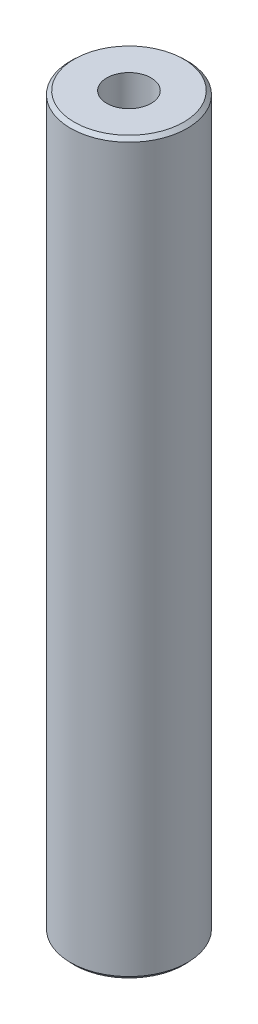
ISO-10303-21;
HEADER;
FILE_DESCRIPTION(('STEP AP214'),'2;1');
FILE_NAME('part.step','',(''),(''),'','','');
FILE_SCHEMA(('AUTOMOTIVE_DESIGN { 1 0 10303 214 1 1 1 1 }'));
ENDSEC;
DATA;
#1=APPLICATION_CONTEXT('core data for automotive mechanical design processes');
#2=APPLICATION_PROTOCOL_DEFINITION('international standard','automotive_design',2000,#1);
#3=PRODUCT_CONTEXT('',#1,'mechanical');
#4=PRODUCT('Part','Part','',(#3));
#5=PRODUCT_RELATED_PRODUCT_CATEGORY('part','',(#4));
#6=PRODUCT_DEFINITION_FORMATION('','',#4);
#7=PRODUCT_DEFINITION_CONTEXT('part definition',#1,'design');
#8=PRODUCT_DEFINITION('design','',#6,#7);
#9=PRODUCT_DEFINITION_SHAPE('','',#8);
#10=(LENGTH_UNIT() NAMED_UNIT(*) SI_UNIT(.MILLI.,.METRE.));
#11=(NAMED_UNIT(*) PLANE_ANGLE_UNIT() SI_UNIT($,.RADIAN.));
#12=(NAMED_UNIT(*) SI_UNIT($,.STERADIAN.) SOLID_ANGLE_UNIT());
#13=UNCERTAINTY_MEASURE_WITH_UNIT(LENGTH_MEASURE(1.E-05),#10,'distance_accuracy_value','');
#14=(GEOMETRIC_REPRESENTATION_CONTEXT(3) GLOBAL_UNCERTAINTY_ASSIGNED_CONTEXT((#13)) GLOBAL_UNIT_ASSIGNED_CONTEXT((#10,
#11,#12)) REPRESENTATION_CONTEXT('',''));
#15=CARTESIAN_POINT('',(0.,0.,0.));
#16=DIRECTION('',(0.,0.,1.));
#17=DIRECTION('',(1.,0.,0.));
#18=AXIS2_PLACEMENT_3D('',#15,#16,#17);
#19=CARTESIAN_POINT('',(0.,593.664447052921,0.));
#20=DIRECTION('',(0.,-1.,0.));
#21=DIRECTION('',(0.,0.,-1.));
#22=AXIS2_PLACEMENT_3D('',#19,#20,#21);
#23=CYLINDRICAL_SURFACE('',#22,47.5);
#24=CARTESIAN_POINT('',(0.,590.858018694106,0.));
#25=DIRECTION('',(0.,1.,0.));
#26=DIRECTION('',(0.,0.,1.));
#27=AXIS2_PLACEMENT_3D('',#24,#25,#26);
#28=CIRCLE('',#27,47.5);
#29=CARTESIAN_POINT('',(0.,590.858018694106,47.5));
#30=VERTEX_POINT('',#29);
#31=EDGE_CURVE('E50',#30,#30,#28,.F.);
#32=ORIENTED_EDGE('',*,*,#31,.T.);
#33=EDGE_LOOP('',(#32));
#34=FACE_BOUND('',#33,.T.);
#35=CARTESIAN_POINT('',(0.,3.01799473669573,0.));
#36=DIRECTION('',(0.,1.,0.));
#37=DIRECTION('',(0.,0.,1.));
#38=AXIS2_PLACEMENT_3D('',#35,#36,#37);
#39=CIRCLE('',#38,47.5);
#40=CARTESIAN_POINT('',(0.,3.01799473669573,47.5));
#41=VERTEX_POINT('',#40);
#42=EDGE_CURVE('E51',#41,#41,#39,.T.);
#43=ORIENTED_EDGE('',*,*,#42,.T.);
#44=EDGE_LOOP('',(#43));
#45=FACE_BOUND('',#44,.T.);
#46=ADVANCED_FACE('F39',(#34,#45),#23,.T.);
#47=CARTESIAN_POINT('',(0.,593.664447052921,0.));
#48=DIRECTION('',(0.,1.,0.));
#49=DIRECTION('',(0.,0.,1.));
#50=AXIS2_PLACEMENT_3D('',#47,#48,#49);
#51=PLANE('',#50);
#52=CARTESIAN_POINT('',(0.,593.664447052921,0.));
#53=DIRECTION('',(0.,1.,0.));
#54=DIRECTION('',(0.,0.,1.));
#55=AXIS2_PLACEMENT_3D('',#52,#53,#54);
#56=CIRCLE('',#55,44.4820052633041);
#57=CARTESIAN_POINT('',(0.,593.664447052921,44.4820052633041));
#58=VERTEX_POINT('',#57);
#59=EDGE_CURVE('E54',#58,#58,#56,.T.);
#60=ORIENTED_EDGE('',*,*,#59,.T.);
#61=EDGE_LOOP('',(#60));
#62=FACE_BOUND('',#61,.T.);
#63=CARTESIAN_POINT('',(0.,593.664447052921,0.));
#64=DIRECTION('',(0.,1.,0.));
#65=DIRECTION('',(0.,0.,1.));
#66=AXIS2_PLACEMENT_3D('',#63,#64,#65);
#67=CIRCLE('',#66,18.027375068369);
#68=CARTESIAN_POINT('',(0.,593.664447052921,18.027375068369));
#69=VERTEX_POINT('',#68);
#70=EDGE_CURVE('E58',#69,#69,#67,.T.);
#71=ORIENTED_EDGE('',*,*,#70,.F.);
#72=EDGE_LOOP('',(#71));
#73=FACE_BOUND('',#72,.T.);
#74=ADVANCED_FACE('F69',(#62,#73),#51,.T.);
#75=CARTESIAN_POINT('',(0.,0.,0.));
#76=DIRECTION('',(0.,1.,0.));
#77=DIRECTION('',(0.,0.,1.));
#78=AXIS2_PLACEMENT_3D('',#75,#76,#77);
#79=PLANE('',#78);
#80=CARTESIAN_POINT('',(0.,0.,0.));
#81=DIRECTION('',(0.,1.,0.));
#82=DIRECTION('',(0.,0.,1.));
#83=AXIS2_PLACEMENT_3D('',#80,#81,#82);
#84=CIRCLE('',#83,44.6935716411853);
#85=CARTESIAN_POINT('',(0.,0.,44.6935716411853));
#86=VERTEX_POINT('',#85);
#87=EDGE_CURVE('E10',#86,#86,#84,.F.);
#88=ORIENTED_EDGE('',*,*,#87,.T.);
#89=EDGE_LOOP('',(#88));
#90=FACE_BOUND('',#89,.T.);
#91=CARTESIAN_POINT('',(0.,0.,0.));
#92=DIRECTION('',(0.,1.,0.));
#93=DIRECTION('',(0.,0.,1.));
#94=AXIS2_PLACEMENT_3D('',#91,#92,#93);
#95=CIRCLE('',#94,18.027375068369);
#96=CARTESIAN_POINT('',(0.,0.,18.027375068369));
#97=VERTEX_POINT('',#96);
#98=EDGE_CURVE('E63',#97,#97,#95,.T.);
#99=ORIENTED_EDGE('',*,*,#98,.T.);
#100=EDGE_LOOP('',(#99));
#101=FACE_BOUND('',#100,.T.);
#102=ADVANCED_FACE('F75',(#90,#101),#79,.F.);
#103=CARTESIAN_POINT('',(0.,593.664447052921,0.));
#104=DIRECTION('',(0.,-1.,0.));
#105=DIRECTION('',(0.,0.,-1.));
#106=AXIS2_PLACEMENT_3D('',#103,#104,#105);
#107=CYLINDRICAL_SURFACE('',#106,18.027375068369);
#108=ORIENTED_EDGE('',*,*,#70,.T.);
#109=EDGE_LOOP('',(#108));
#110=FACE_BOUND('',#109,.T.);
#111=ORIENTED_EDGE('',*,*,#98,.F.);
#112=EDGE_LOOP('',(#111));
#113=FACE_BOUND('',#112,.T.);
#114=ADVANCED_FACE('F70',(#110,#113),#107,.F.);
#115=CARTESIAN_POINT('',(0.,593.664447052921,0.));
#116=DIRECTION('',(0.,-1.,0.));
#117=DIRECTION('',(0.,0.,-1.));
#118=AXIS2_PLACEMENT_3D('',#115,#116,#117);
#119=CONICAL_SURFACE('',#118,44.4820052633041,0.821706206058378);
#120=ORIENTED_EDGE('',*,*,#31,.F.);
#121=EDGE_LOOP('',(#120));
#122=FACE_BOUND('',#121,.T.);
#123=ORIENTED_EDGE('',*,*,#59,.F.);
#124=EDGE_LOOP('',(#123));
#125=FACE_BOUND('',#124,.T.);
#126=ADVANCED_FACE('F81',(#122,#125),#119,.T.);
#127=CARTESIAN_POINT('',(0.,3.01799473669573,0.));
#128=DIRECTION('',(0.,1.,0.));
#129=DIRECTION('',(0.,0.,1.));
#130=AXIS2_PLACEMENT_3D('',#127,#128,#129);
#131=CONICAL_SURFACE('',#130,47.5,0.749090120736514);
#132=ORIENTED_EDGE('',*,*,#87,.F.);
#133=EDGE_LOOP('',(#132));
#134=FACE_BOUND('',#133,.T.);
#135=ORIENTED_EDGE('',*,*,#42,.F.);
#136=EDGE_LOOP('',(#135));
#137=FACE_BOUND('',#136,.T.);
#138=ADVANCED_FACE('F45',(#134,#137),#131,.T.);
#139=CLOSED_SHELL('',(#46,#74,#102,#114,#126,#138));
#140=MANIFOLD_SOLID_BREP('B2',#139);
#141=ADVANCED_BREP_SHAPE_REPRESENTATION('',(#18,#140),#14);
#142=SHAPE_DEFINITION_REPRESENTATION(#9,#141);
ENDSEC;
END-ISO-10303-21;
